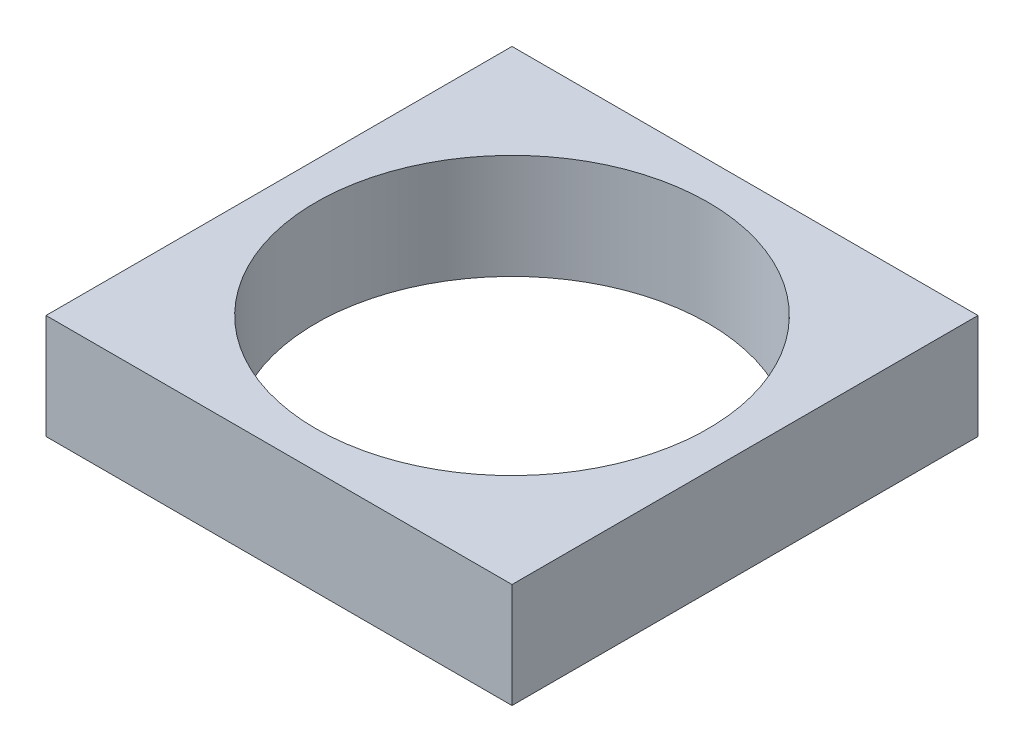
ISO-10303-21;
HEADER;
FILE_DESCRIPTION(('STEP AP214'),'2;1');
FILE_NAME('part.step','',(''),(''),'','','');
FILE_SCHEMA(('AUTOMOTIVE_DESIGN { 1 0 10303 214 1 1 1 1 }'));
ENDSEC;
DATA;
#1=APPLICATION_CONTEXT('core data for automotive mechanical design processes');
#2=APPLICATION_PROTOCOL_DEFINITION('international standard','automotive_design',2000,#1);
#3=PRODUCT_CONTEXT('',#1,'mechanical');
#4=PRODUCT('Part','Part','',(#3));
#5=PRODUCT_RELATED_PRODUCT_CATEGORY('part','',(#4));
#6=PRODUCT_DEFINITION_FORMATION('','',#4);
#7=PRODUCT_DEFINITION_CONTEXT('part definition',#1,'design');
#8=PRODUCT_DEFINITION('design','',#6,#7);
#9=PRODUCT_DEFINITION_SHAPE('','',#8);
#10=(LENGTH_UNIT() NAMED_UNIT(*) SI_UNIT(.MILLI.,.METRE.));
#11=(NAMED_UNIT(*) PLANE_ANGLE_UNIT() SI_UNIT($,.RADIAN.));
#12=(NAMED_UNIT(*) SI_UNIT($,.STERADIAN.) SOLID_ANGLE_UNIT());
#13=UNCERTAINTY_MEASURE_WITH_UNIT(LENGTH_MEASURE(1.E-05),#10,'distance_accuracy_value','');
#14=(GEOMETRIC_REPRESENTATION_CONTEXT(3) GLOBAL_UNCERTAINTY_ASSIGNED_CONTEXT((#13)) GLOBAL_UNIT_ASSIGNED_CONTEXT((#10,
#11,#12)) REPRESENTATION_CONTEXT('',''));
#15=CARTESIAN_POINT('',(0.,0.,0.));
#16=DIRECTION('',(0.,0.,1.));
#17=DIRECTION('',(1.,0.,0.));
#18=AXIS2_PLACEMENT_3D('',#15,#16,#17);
#19=CARTESIAN_POINT('',(0.,2.7,0.));
#20=DIRECTION('',(0.,1.,0.));
#21=DIRECTION('',(0.,0.,1.));
#22=AXIS2_PLACEMENT_3D('',#19,#20,#21);
#23=PLANE('',#22);
#24=DIRECTION('',(0.,0.,-1.));
#25=VECTOR('',#24,1.);
#26=CARTESIAN_POINT('',(6.,2.7,-6.));
#27=LINE('',#26,#25);
#28=CARTESIAN_POINT('',(6.,2.7,6.));
#29=VERTEX_POINT('',#28);
#30=CARTESIAN_POINT('',(6.,2.7,-6.));
#31=VERTEX_POINT('',#30);
#32=EDGE_CURVE('E89',#29,#31,#27,.T.);
#33=ORIENTED_EDGE('',*,*,#32,.T.);
#34=DIRECTION('',(-1.,0.,0.));
#35=VECTOR('',#34,1.);
#36=CARTESIAN_POINT('',(-6.,2.7,-6.));
#37=LINE('',#36,#35);
#38=CARTESIAN_POINT('',(-6.,2.7,-6.));
#39=VERTEX_POINT('',#38);
#40=EDGE_CURVE('E84',#31,#39,#37,.T.);
#41=ORIENTED_EDGE('',*,*,#40,.T.);
#42=DIRECTION('',(0.,0.,1.));
#43=VECTOR('',#42,1.);
#44=CARTESIAN_POINT('',(-6.,2.7,-6.));
#45=LINE('',#44,#43);
#46=CARTESIAN_POINT('',(-6.,2.7,6.));
#47=VERTEX_POINT('',#46);
#48=EDGE_CURVE('E87',#39,#47,#45,.T.);
#49=ORIENTED_EDGE('',*,*,#48,.T.);
#50=DIRECTION('',(1.,0.,0.));
#51=VECTOR('',#50,1.);
#52=CARTESIAN_POINT('',(-6.,2.7,6.));
#53=LINE('',#52,#51);
#54=EDGE_CURVE('E54',#47,#29,#53,.T.);
#55=ORIENTED_EDGE('',*,*,#54,.T.);
#56=EDGE_LOOP('',(#33,#41,#49,#55));
#57=FACE_BOUND('',#56,.T.);
#58=CARTESIAN_POINT('',(0.,2.7,0.));
#59=DIRECTION('',(0.,1.,0.));
#60=DIRECTION('',(0.,0.,1.));
#61=AXIS2_PLACEMENT_3D('',#58,#59,#60);
#62=CIRCLE('',#61,5.05);
#63=CARTESIAN_POINT('',(0.,2.7,5.05));
#64=VERTEX_POINT('',#63);
#65=EDGE_CURVE('E104',#64,#64,#62,.T.);
#66=ORIENTED_EDGE('',*,*,#65,.F.);
#67=EDGE_LOOP('',(#66));
#68=FACE_BOUND('',#67,.T.);
#69=ADVANCED_FACE('F37',(#57,#68),#23,.T.);
#70=CARTESIAN_POINT('',(0.,0.,0.));
#71=DIRECTION('',(0.,1.,0.));
#72=DIRECTION('',(0.,0.,1.));
#73=AXIS2_PLACEMENT_3D('',#70,#71,#72);
#74=PLANE('',#73);
#75=DIRECTION('',(0.,0.,-1.));
#76=VECTOR('',#75,1.);
#77=CARTESIAN_POINT('',(6.,0.,-6.));
#78=LINE('',#77,#76);
#79=CARTESIAN_POINT('',(6.,0.,6.));
#80=VERTEX_POINT('',#79);
#81=CARTESIAN_POINT('',(6.,0.,-6.));
#82=VERTEX_POINT('',#81);
#83=EDGE_CURVE('E101',#80,#82,#78,.T.);
#84=ORIENTED_EDGE('',*,*,#83,.F.);
#85=DIRECTION('',(1.,0.,0.));
#86=VECTOR('',#85,1.);
#87=CARTESIAN_POINT('',(-6.,0.,6.));
#88=LINE('',#87,#86);
#89=CARTESIAN_POINT('',(-6.,0.,6.));
#90=VERTEX_POINT('',#89);
#91=EDGE_CURVE('E77',#90,#80,#88,.T.);
#92=ORIENTED_EDGE('',*,*,#91,.F.);
#93=DIRECTION('',(0.,0.,1.));
#94=VECTOR('',#93,1.);
#95=CARTESIAN_POINT('',(-6.,0.,-6.));
#96=LINE('',#95,#94);
#97=CARTESIAN_POINT('',(-6.,0.,-6.));
#98=VERTEX_POINT('',#97);
#99=EDGE_CURVE('E71',#98,#90,#96,.T.);
#100=ORIENTED_EDGE('',*,*,#99,.F.);
#101=DIRECTION('',(-1.,0.,0.));
#102=VECTOR('',#101,1.);
#103=CARTESIAN_POINT('',(-6.,0.,-6.));
#104=LINE('',#103,#102);
#105=EDGE_CURVE('E93',#82,#98,#104,.T.);
#106=ORIENTED_EDGE('',*,*,#105,.F.);
#107=EDGE_LOOP('',(#84,#92,#100,#106));
#108=FACE_BOUND('',#107,.T.);
#109=CARTESIAN_POINT('',(0.,0.,0.));
#110=DIRECTION('',(0.,1.,0.));
#111=DIRECTION('',(0.,0.,1.));
#112=AXIS2_PLACEMENT_3D('',#109,#110,#111);
#113=CIRCLE('',#112,5.05);
#114=CARTESIAN_POINT('',(0.,0.,5.05));
#115=VERTEX_POINT('',#114);
#116=EDGE_CURVE('E116',#115,#115,#113,.T.);
#117=ORIENTED_EDGE('',*,*,#116,.T.);
#118=EDGE_LOOP('',(#117));
#119=FACE_BOUND('',#118,.T.);
#120=ADVANCED_FACE('F112',(#108,#119),#74,.F.);
#121=CARTESIAN_POINT('',(6.,2.7,-6.));
#122=DIRECTION('',(-1.,0.,0.));
#123=DIRECTION('',(0.,0.,1.));
#124=AXIS2_PLACEMENT_3D('',#121,#122,#123);
#125=PLANE('',#124);
#126=ORIENTED_EDGE('',*,*,#83,.T.);
#127=DIRECTION('',(0.,-1.,0.));
#128=VECTOR('',#127,1.);
#129=CARTESIAN_POINT('',(6.,2.7,-6.));
#130=LINE('',#129,#128);
#131=EDGE_CURVE('E11',#31,#82,#130,.T.);
#132=ORIENTED_EDGE('',*,*,#131,.F.);
#133=ORIENTED_EDGE('',*,*,#32,.F.);
#134=DIRECTION('',(0.,-1.,0.));
#135=VECTOR('',#134,1.);
#136=CARTESIAN_POINT('',(6.,2.7,6.));
#137=LINE('',#136,#135);
#138=EDGE_CURVE('E97',#29,#80,#137,.T.);
#139=ORIENTED_EDGE('',*,*,#138,.T.);
#140=EDGE_LOOP('',(#126,#132,#133,#139));
#141=FACE_BOUND('',#140,.T.);
#142=ADVANCED_FACE('F39',(#141),#125,.F.);
#143=CARTESIAN_POINT('',(-6.,2.7,-6.));
#144=DIRECTION('',(0.,0.,1.));
#145=DIRECTION('',(1.,0.,0.));
#146=AXIS2_PLACEMENT_3D('',#143,#144,#145);
#147=PLANE('',#146);
#148=ORIENTED_EDGE('',*,*,#105,.T.);
#149=DIRECTION('',(0.,-1.,0.));
#150=VECTOR('',#149,1.);
#151=CARTESIAN_POINT('',(-6.,2.7,-6.));
#152=LINE('',#151,#150);
#153=EDGE_CURVE('E46',#39,#98,#152,.T.);
#154=ORIENTED_EDGE('',*,*,#153,.F.);
#155=ORIENTED_EDGE('',*,*,#40,.F.);
#156=ORIENTED_EDGE('',*,*,#131,.T.);
#157=EDGE_LOOP('',(#148,#154,#155,#156));
#158=FACE_BOUND('',#157,.T.);
#159=ADVANCED_FACE('F92',(#158),#147,.F.);
#160=CARTESIAN_POINT('',(-6.,2.7,-6.));
#161=DIRECTION('',(1.,0.,0.));
#162=DIRECTION('',(0.,0.,-1.));
#163=AXIS2_PLACEMENT_3D('',#160,#161,#162);
#164=PLANE('',#163);
#165=ORIENTED_EDGE('',*,*,#99,.T.);
#166=DIRECTION('',(0.,-1.,0.));
#167=VECTOR('',#166,1.);
#168=CARTESIAN_POINT('',(-6.,2.7,6.));
#169=LINE('',#168,#167);
#170=EDGE_CURVE('E94',#47,#90,#169,.T.);
#171=ORIENTED_EDGE('',*,*,#170,.F.);
#172=ORIENTED_EDGE('',*,*,#48,.F.);
#173=ORIENTED_EDGE('',*,*,#153,.T.);
#174=EDGE_LOOP('',(#165,#171,#172,#173));
#175=FACE_BOUND('',#174,.T.);
#176=ADVANCED_FACE('F95',(#175),#164,.F.);
#177=CARTESIAN_POINT('',(-6.,2.7,6.));
#178=DIRECTION('',(0.,0.,-1.));
#179=DIRECTION('',(-1.,0.,0.));
#180=AXIS2_PLACEMENT_3D('',#177,#178,#179);
#181=PLANE('',#180);
#182=ORIENTED_EDGE('',*,*,#91,.T.);
#183=ORIENTED_EDGE('',*,*,#138,.F.);
#184=ORIENTED_EDGE('',*,*,#54,.F.);
#185=ORIENTED_EDGE('',*,*,#170,.T.);
#186=EDGE_LOOP('',(#182,#183,#184,#185));
#187=FACE_BOUND('',#186,.T.);
#188=ADVANCED_FACE('F109',(#187),#181,.F.);
#189=CARTESIAN_POINT('',(0.,2.7,0.));
#190=DIRECTION('',(0.,-1.,0.));
#191=DIRECTION('',(0.,0.,-1.));
#192=AXIS2_PLACEMENT_3D('',#189,#190,#191);
#193=CYLINDRICAL_SURFACE('',#192,5.05);
#194=ORIENTED_EDGE('',*,*,#65,.T.);
#195=EDGE_LOOP('',(#194));
#196=FACE_BOUND('',#195,.T.);
#197=ORIENTED_EDGE('',*,*,#116,.F.);
#198=EDGE_LOOP('',(#197));
#199=FACE_BOUND('',#198,.T.);
#200=ADVANCED_FACE('F122',(#196,#199),#193,.F.);
#201=CLOSED_SHELL('',(#69,#120,#142,#159,#176,#188,#200));
#202=MANIFOLD_SOLID_BREP('B2',#201);
#203=ADVANCED_BREP_SHAPE_REPRESENTATION('',(#18,#202),#14);
#204=SHAPE_DEFINITION_REPRESENTATION(#9,#203);
ENDSEC;
END-ISO-10303-21;
